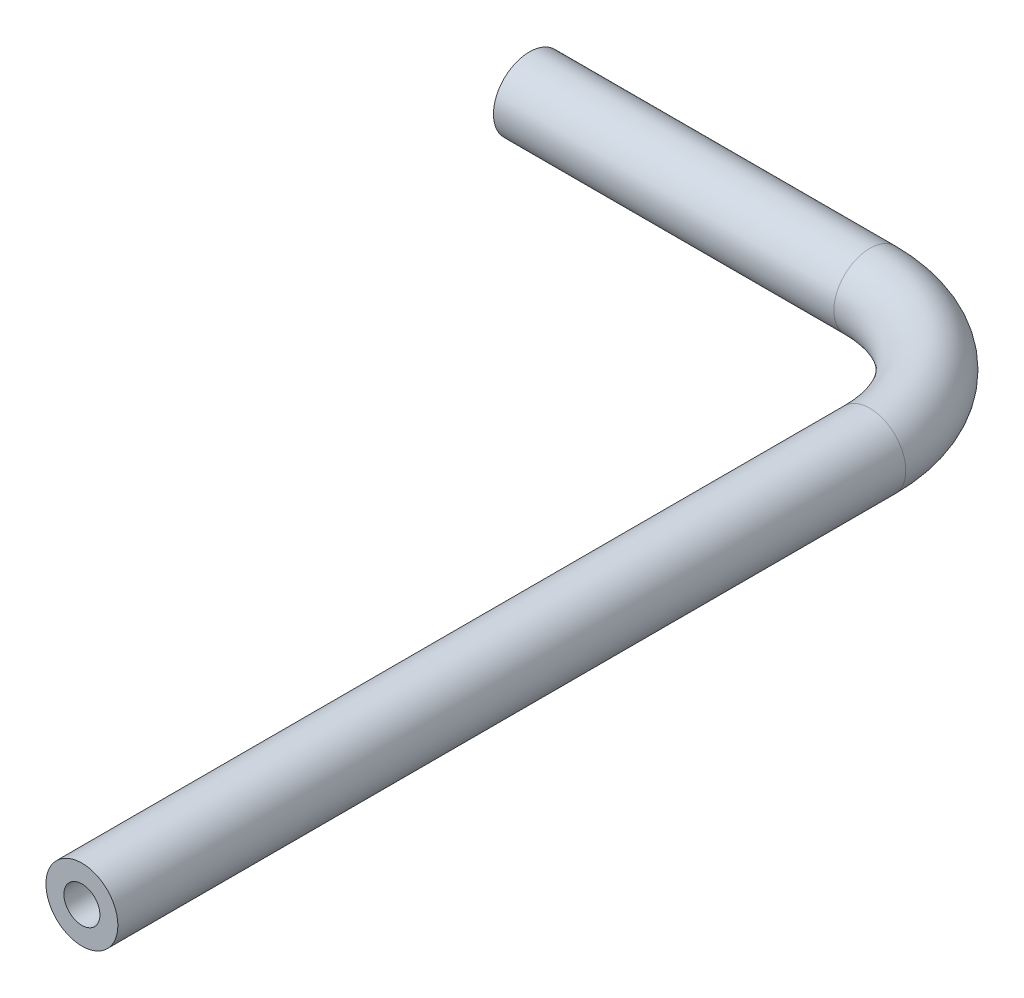
ISO-10303-21;
HEADER;
FILE_DESCRIPTION(('STEP AP214'),'2;1');
FILE_NAME('part.step','',(''),(''),'','','');
FILE_SCHEMA(('AUTOMOTIVE_DESIGN { 1 0 10303 214 1 1 1 1 }'));
ENDSEC;
DATA;
#1=APPLICATION_CONTEXT('core data for automotive mechanical design processes');
#2=APPLICATION_PROTOCOL_DEFINITION('international standard','automotive_design',2000,#1);
#3=PRODUCT_CONTEXT('',#1,'mechanical');
#4=PRODUCT('Part','Part','',(#3));
#5=PRODUCT_RELATED_PRODUCT_CATEGORY('part','',(#4));
#6=PRODUCT_DEFINITION_FORMATION('','',#4);
#7=PRODUCT_DEFINITION_CONTEXT('part definition',#1,'design');
#8=PRODUCT_DEFINITION('design','',#6,#7);
#9=PRODUCT_DEFINITION_SHAPE('','',#8);
#10=(LENGTH_UNIT() NAMED_UNIT(*) SI_UNIT(.MILLI.,.METRE.));
#11=(NAMED_UNIT(*) PLANE_ANGLE_UNIT() SI_UNIT($,.RADIAN.));
#12=(NAMED_UNIT(*) SI_UNIT($,.STERADIAN.) SOLID_ANGLE_UNIT());
#13=UNCERTAINTY_MEASURE_WITH_UNIT(LENGTH_MEASURE(1.E-05),#10,'distance_accuracy_value','');
#14=(GEOMETRIC_REPRESENTATION_CONTEXT(3) GLOBAL_UNCERTAINTY_ASSIGNED_CONTEXT((#13)) GLOBAL_UNIT_ASSIGNED_CONTEXT((#10,
#11,#12)) REPRESENTATION_CONTEXT('',''));
#15=CARTESIAN_POINT('',(0.,0.,0.));
#16=DIRECTION('',(0.,0.,1.));
#17=DIRECTION('',(1.,0.,0.));
#18=AXIS2_PLACEMENT_3D('',#15,#16,#17);
#19=CARTESIAN_POINT('',(60.8594123792687,0.,106.555716131387));
#20=DIRECTION('',(0.,0.,-1.));
#21=DIRECTION('',(-1.,0.,0.));
#22=AXIS2_PLACEMENT_3D('',#19,#20,#21);
#23=CYLINDRICAL_SURFACE('',#22,4.572);
#24=CARTESIAN_POINT('',(60.8594123792687,0.,6.40792910146186));
#25=DIRECTION('',(0.,0.,1.));
#26=DIRECTION('',(1.,0.,0.));
#27=AXIS2_PLACEMENT_3D('',#24,#25,#26);
#28=CIRCLE('',#27,4.572);
#29=CARTESIAN_POINT('',(65.4314123792687,0.,6.40792910146185));
#30=VERTEX_POINT('',#29);
#31=EDGE_CURVE('E55',#30,#30,#28,.T.);
#32=ORIENTED_EDGE('',*,*,#31,.T.);
#33=EDGE_LOOP('',(#32));
#34=FACE_BOUND('',#33,.T.);
#35=CARTESIAN_POINT('',(60.8594123792687,0.,106.555716131387));
#36=DIRECTION('',(0.,0.,1.));
#37=DIRECTION('',(1.,0.,0.));
#38=AXIS2_PLACEMENT_3D('',#35,#36,#37);
#39=CIRCLE('',#38,4.572);
#40=CARTESIAN_POINT('',(65.4314123792687,0.,106.555716131387));
#41=VERTEX_POINT('',#40);
#42=EDGE_CURVE('E53',#41,#41,#39,.T.);
#43=ORIENTED_EDGE('',*,*,#42,.F.);
#44=EDGE_LOOP('',(#43));
#45=FACE_BOUND('',#44,.T.);
#46=ADVANCED_FACE('F32',(#34,#45),#23,.T.);
#47=CARTESIAN_POINT('',(43.2667631613333,0.,6.40792910146188));
#48=DIRECTION('',(0.,1.,0.));
#49=DIRECTION('',(0.,0.,1.));
#50=AXIS2_PLACEMENT_3D('',#47,#48,#49);
#51=TOROIDAL_SURFACE('',#50,17.5926492179354,4.572);
#52=CARTESIAN_POINT('',(43.2667631613333,0.,-11.1847201164736));
#53=DIRECTION('',(1.,0.,0.));
#54=DIRECTION('',(0.,0.,-1.));
#55=AXIS2_PLACEMENT_3D('',#52,#53,#54);
#56=CIRCLE('',#55,4.572);
#57=CARTESIAN_POINT('',(43.2667631613332,0.,-15.7567201164736));
#58=VERTEX_POINT('',#57);
#59=EDGE_CURVE('E36',#58,#58,#56,.T.);
#60=CARTESIAN_POINT('',(43.2667631613333,0.,6.40792910146188));
#61=DIRECTION('',(0.,1.,0.));
#62=DIRECTION('',(0.,0.,1.));
#63=AXIS2_PLACEMENT_3D('',#60,#61,#62);
#64=CIRCLE('',#63,22.1646492179354);
#65=EDGE_CURVE('',#30,#58,#64,.T.);
#66=ORIENTED_EDGE('',*,*,#31,.F.);
#67=ORIENTED_EDGE('',*,*,#59,.T.);
#68=ORIENTED_EDGE('',*,*,#65,.T.);
#69=ORIENTED_EDGE('',*,*,#65,.F.);
#70=EDGE_LOOP('',(#66,#68,#67,#69));
#71=FACE_BOUND('',#70,.T.);
#72=ADVANCED_FACE('F62',(#71),#51,.T.);
#73=CARTESIAN_POINT('',(43.2667631613333,0.,-11.1847201164736));
#74=DIRECTION('',(-1.,0.,0.));
#75=DIRECTION('',(0.,0.,1.));
#76=AXIS2_PLACEMENT_3D('',#73,#74,#75);
#77=CYLINDRICAL_SURFACE('',#76,4.572);
#78=CARTESIAN_POINT('',(0.,0.,-11.1847201164736));
#79=DIRECTION('',(1.,0.,0.));
#80=DIRECTION('',(0.,0.,-1.));
#81=AXIS2_PLACEMENT_3D('',#78,#79,#80);
#82=CIRCLE('',#81,4.572);
#83=CARTESIAN_POINT('',(0.,0.,-15.7567201164736));
#84=VERTEX_POINT('',#83);
#85=EDGE_CURVE('E49',#84,#84,#82,.T.);
#86=ORIENTED_EDGE('',*,*,#85,.T.);
#87=EDGE_LOOP('',(#86));
#88=FACE_BOUND('',#87,.T.);
#89=ORIENTED_EDGE('',*,*,#59,.F.);
#90=EDGE_LOOP('',(#89));
#91=FACE_BOUND('',#90,.T.);
#92=ADVANCED_FACE('F34',(#88,#91),#77,.T.);
#93=CARTESIAN_POINT('',(60.8594123792687,0.,106.555716131387));
#94=DIRECTION('',(0.,0.,1.));
#95=DIRECTION('',(1.,0.,0.));
#96=AXIS2_PLACEMENT_3D('',#93,#94,#95);
#97=PLANE('',#96);
#98=CARTESIAN_POINT('',(60.8594123792687,0.,106.555716131387));
#99=DIRECTION('',(0.,0.,1.));
#100=DIRECTION('',(1.,0.,0.));
#101=AXIS2_PLACEMENT_3D('',#98,#99,#100);
#102=CIRCLE('',#101,2.286);
#103=CARTESIAN_POINT('',(63.1454123792687,0.,106.555716131387));
#104=VERTEX_POINT('',#103);
#105=EDGE_CURVE('E52',#104,#104,#102,.F.);
#106=ORIENTED_EDGE('',*,*,#105,.T.);
#107=EDGE_LOOP('',(#106));
#108=FACE_BOUND('',#107,.T.);
#109=ORIENTED_EDGE('',*,*,#42,.T.);
#110=EDGE_LOOP('',(#109));
#111=FACE_BOUND('',#110,.T.);
#112=ADVANCED_FACE('F66',(#108,#111),#97,.T.);
#113=CARTESIAN_POINT('',(0.,0.,-11.1847201164736));
#114=DIRECTION('',(1.,0.,0.));
#115=DIRECTION('',(0.,0.,-1.));
#116=AXIS2_PLACEMENT_3D('',#113,#114,#115);
#117=PLANE('',#116);
#118=CARTESIAN_POINT('',(0.,0.,-11.1847201164736));
#119=DIRECTION('',(1.,0.,0.));
#120=DIRECTION('',(0.,0.,-1.));
#121=AXIS2_PLACEMENT_3D('',#118,#119,#120);
#122=CIRCLE('',#121,2.286);
#123=CARTESIAN_POINT('',(0.,0.,-13.4707201164736));
#124=VERTEX_POINT('',#123);
#125=EDGE_CURVE('E10',#124,#124,#122,.F.);
#126=ORIENTED_EDGE('',*,*,#125,.F.);
#127=EDGE_LOOP('',(#126));
#128=FACE_BOUND('',#127,.T.);
#129=ORIENTED_EDGE('',*,*,#85,.F.);
#130=EDGE_LOOP('',(#129));
#131=FACE_BOUND('',#130,.T.);
#132=ADVANCED_FACE('F72',(#128,#131),#117,.F.);
#133=CARTESIAN_POINT('',(60.8594123792687,0.,106.555716131387));
#134=DIRECTION('',(0.,0.,-1.));
#135=DIRECTION('',(-1.,0.,0.));
#136=AXIS2_PLACEMENT_3D('',#133,#134,#135);
#137=CYLINDRICAL_SURFACE('',#136,2.286);
#138=CARTESIAN_POINT('',(60.8594123792687,0.,6.40792910146186));
#139=DIRECTION('',(0.,0.,1.));
#140=DIRECTION('',(1.,0.,0.));
#141=AXIS2_PLACEMENT_3D('',#138,#139,#140);
#142=CIRCLE('',#141,2.286);
#143=CARTESIAN_POINT('',(63.1454123792687,0.,6.40792910146186));
#144=VERTEX_POINT('',#143);
#145=EDGE_CURVE('E45',#144,#144,#142,.F.);
#146=ORIENTED_EDGE('',*,*,#145,.T.);
#147=EDGE_LOOP('',(#146));
#148=FACE_BOUND('',#147,.T.);
#149=ORIENTED_EDGE('',*,*,#105,.F.);
#150=EDGE_LOOP('',(#149));
#151=FACE_BOUND('',#150,.T.);
#152=ADVANCED_FACE('F82',(#148,#151),#137,.F.);
#153=CARTESIAN_POINT('',(43.2667631613333,0.,6.40792910146188));
#154=DIRECTION('',(0.,1.,0.));
#155=DIRECTION('',(0.,0.,1.));
#156=AXIS2_PLACEMENT_3D('',#153,#154,#155);
#157=TOROIDAL_SURFACE('',#156,17.5926492179354,2.286);
#158=CARTESIAN_POINT('',(43.2667631613333,0.,-11.1847201164736));
#159=DIRECTION('',(1.,0.,0.));
#160=DIRECTION('',(0.,0.,-1.));
#161=AXIS2_PLACEMENT_3D('',#158,#159,#160);
#162=CIRCLE('',#161,2.286);
#163=CARTESIAN_POINT('',(43.2667631613333,0.,-13.4707201164736));
#164=VERTEX_POINT('',#163);
#165=EDGE_CURVE('E40',#164,#164,#162,.F.);
#166=CARTESIAN_POINT('',(43.2667631613333,0.,6.40792910146188));
#167=DIRECTION('',(0.,1.,0.));
#168=DIRECTION('',(0.,0.,1.));
#169=AXIS2_PLACEMENT_3D('',#166,#167,#168);
#170=CIRCLE('',#169,19.8786492179355);
#171=EDGE_CURVE('',#144,#164,#170,.T.);
#172=ORIENTED_EDGE('',*,*,#145,.F.);
#173=ORIENTED_EDGE('',*,*,#165,.T.);
#174=ORIENTED_EDGE('',*,*,#171,.T.);
#175=ORIENTED_EDGE('',*,*,#171,.F.);
#176=EDGE_LOOP('',(#172,#174,#173,#175));
#177=FACE_BOUND('',#176,.T.);
#178=ADVANCED_FACE('F77',(#177),#157,.F.);
#179=CARTESIAN_POINT('',(43.2667631613333,0.,-11.1847201164736));
#180=DIRECTION('',(-1.,0.,0.));
#181=DIRECTION('',(0.,0.,1.));
#182=AXIS2_PLACEMENT_3D('',#179,#180,#181);
#183=CYLINDRICAL_SURFACE('',#182,2.286);
#184=ORIENTED_EDGE('',*,*,#125,.T.);
#185=EDGE_LOOP('',(#184));
#186=FACE_BOUND('',#185,.T.);
#187=ORIENTED_EDGE('',*,*,#165,.F.);
#188=EDGE_LOOP('',(#187));
#189=FACE_BOUND('',#188,.T.);
#190=ADVANCED_FACE('F75',(#186,#189),#183,.F.);
#191=CLOSED_SHELL('',(#46,#72,#92,#112,#132,#152,#178,#190));
#192=MANIFOLD_SOLID_BREP('B2',#191);
#193=ADVANCED_BREP_SHAPE_REPRESENTATION('',(#18,#192),#14);
#194=SHAPE_DEFINITION_REPRESENTATION(#9,#193);
ENDSEC;
END-ISO-10303-21;
